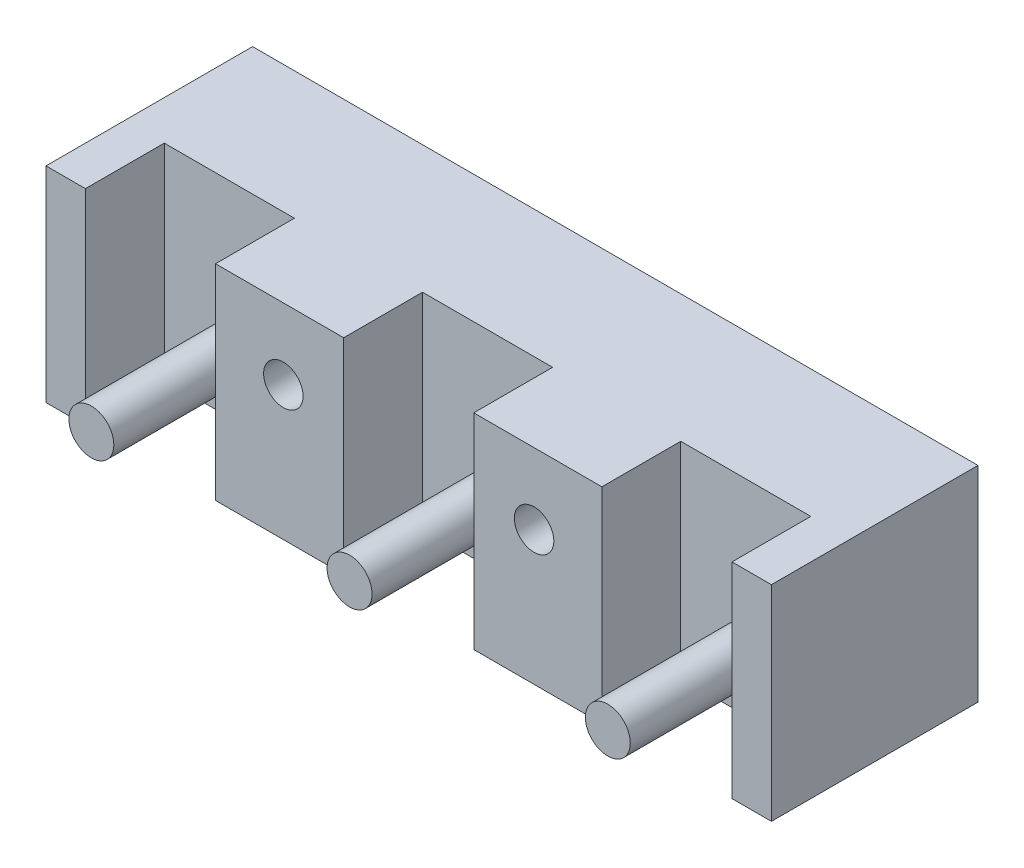
ISO-10303-21;
HEADER;
FILE_DESCRIPTION(('STEP AP214'),'2;1');
FILE_NAME('part.step','',(''),(''),'','','');
FILE_SCHEMA(('AUTOMOTIVE_DESIGN { 1 0 10303 214 1 1 1 1 }'));
ENDSEC;
DATA;
#1=APPLICATION_CONTEXT('core data for automotive mechanical design processes');
#2=APPLICATION_PROTOCOL_DEFINITION('international standard','automotive_design',2000,#1);
#3=PRODUCT_CONTEXT('',#1,'mechanical');
#4=PRODUCT('Part','Part','',(#3));
#5=PRODUCT_RELATED_PRODUCT_CATEGORY('part','',(#4));
#6=PRODUCT_DEFINITION_FORMATION('','',#4);
#7=PRODUCT_DEFINITION_CONTEXT('part definition',#1,'design');
#8=PRODUCT_DEFINITION('design','',#6,#7);
#9=PRODUCT_DEFINITION_SHAPE('','',#8);
#10=(LENGTH_UNIT() NAMED_UNIT(*) SI_UNIT(.MILLI.,.METRE.));
#11=(NAMED_UNIT(*) PLANE_ANGLE_UNIT() SI_UNIT($,.RADIAN.));
#12=(NAMED_UNIT(*) SI_UNIT($,.STERADIAN.) SOLID_ANGLE_UNIT());
#13=UNCERTAINTY_MEASURE_WITH_UNIT(LENGTH_MEASURE(1.E-05),#10,'distance_accuracy_value','');
#14=(GEOMETRIC_REPRESENTATION_CONTEXT(3) GLOBAL_UNCERTAINTY_ASSIGNED_CONTEXT((#13)) GLOBAL_UNIT_ASSIGNED_CONTEXT((#10,
#11,#12)) REPRESENTATION_CONTEXT('',''));
#15=CARTESIAN_POINT('',(0.,0.,0.));
#16=DIRECTION('',(0.,0.,1.));
#17=DIRECTION('',(1.,0.,0.));
#18=AXIS2_PLACEMENT_3D('',#15,#16,#17);
#19=CARTESIAN_POINT('',(0.,0.,26.2));
#20=DIRECTION('',(0.,0.,-1.));
#21=DIRECTION('',(-1.,0.,0.));
#22=AXIS2_PLACEMENT_3D('',#19,#20,#21);
#23=PLANE('',#22);
#24=CARTESIAN_POINT('',(-15.9,4.00000000000001,26.2));
#25=DIRECTION('',(0.,0.,-1.));
#26=DIRECTION('',(-1.,0.,0.));
#27=AXIS2_PLACEMENT_3D('',#24,#25,#26);
#28=CIRCLE('',#27,2.5);
#29=CARTESIAN_POINT('',(-18.4,4.00000000000001,26.2));
#30=VERTEX_POINT('',#29);
#31=EDGE_CURVE('E558',#30,#30,#28,.T.);
#32=ORIENTED_EDGE('',*,*,#31,.T.);
#33=EDGE_LOOP('',(#32));
#34=FACE_BOUND('',#33,.T.);
#35=DIRECTION('',(-1.,0.,0.));
#36=VECTOR('',#35,1.);
#37=CARTESIAN_POINT('',(46.,13.,26.2));
#38=LINE('',#37,#36);
#39=CARTESIAN_POINT('',(-8.25,13.,26.2));
#40=VERTEX_POINT('',#39);
#41=CARTESIAN_POINT('',(-24.5,13.,26.2));
#42=VERTEX_POINT('',#41);
#43=EDGE_CURVE('E304',#40,#42,#38,.T.);
#44=ORIENTED_EDGE('',*,*,#43,.T.);
#45=DIRECTION('',(0.,-1.,0.));
#46=VECTOR('',#45,1.);
#47=CARTESIAN_POINT('',(-24.5,13.,26.2));
#48=LINE('',#47,#46);
#49=CARTESIAN_POINT('',(-24.5,-13.,26.2));
#50=VERTEX_POINT('',#49);
#51=EDGE_CURVE('E180',#42,#50,#48,.T.);
#52=ORIENTED_EDGE('',*,*,#51,.T.);
#53=DIRECTION('',(1.,0.,0.));
#54=VECTOR('',#53,1.);
#55=CARTESIAN_POINT('',(46.,-13.,26.2));
#56=LINE('',#55,#54);
#57=CARTESIAN_POINT('',(-8.25,-13.,26.2));
#58=VERTEX_POINT('',#57);
#59=EDGE_CURVE('E245',#50,#58,#56,.T.);
#60=ORIENTED_EDGE('',*,*,#59,.T.);
#61=DIRECTION('',(0.,-1.,0.));
#62=VECTOR('',#61,1.);
#63=CARTESIAN_POINT('',(-8.25,13.,26.2));
#64=LINE('',#63,#62);
#65=EDGE_CURVE('E178',#40,#58,#64,.T.);
#66=ORIENTED_EDGE('',*,*,#65,.F.);
#67=EDGE_LOOP('',(#44,#52,#60,#66));
#68=FACE_BOUND('',#67,.T.);
#69=ADVANCED_FACE('F34',(#34,#68),#23,.F.);
#70=CARTESIAN_POINT('',(-46.,-13.,26.2));
#71=VERTEX_POINT('',#70);
#72=CARTESIAN_POINT('',(-41.,-13.,26.2));
#73=VERTEX_POINT('',#72);
#74=EDGE_CURVE('E241',#71,#73,#56,.T.);
#75=ORIENTED_EDGE('',*,*,#74,.T.);
#76=DIRECTION('',(0.,-1.,0.));
#77=VECTOR('',#76,1.);
#78=CARTESIAN_POINT('',(-41.,13.,26.2));
#79=LINE('',#78,#77);
#80=CARTESIAN_POINT('',(-41.,13.,26.2));
#81=VERTEX_POINT('',#80);
#82=EDGE_CURVE('E154',#81,#73,#79,.T.);
#83=ORIENTED_EDGE('',*,*,#82,.F.);
#84=CARTESIAN_POINT('',(-46.,13.,26.2));
#85=VERTEX_POINT('',#84);
#86=EDGE_CURVE('E167',#81,#85,#38,.T.);
#87=ORIENTED_EDGE('',*,*,#86,.T.);
#88=DIRECTION('',(0.,-1.,0.));
#89=VECTOR('',#88,1.);
#90=CARTESIAN_POINT('',(-46.,13.,26.2));
#91=LINE('',#90,#89);
#92=EDGE_CURVE('E236',#85,#71,#91,.T.);
#93=ORIENTED_EDGE('',*,*,#92,.T.);
#94=EDGE_LOOP('',(#75,#83,#87,#93));
#95=FACE_BOUND('',#94,.T.);
#96=ADVANCED_FACE('F310',(#95),#23,.F.);
#97=CARTESIAN_POINT('',(46.,13.,26.2));
#98=VERTEX_POINT('',#97);
#99=CARTESIAN_POINT('',(41.,13.,26.2));
#100=VERTEX_POINT('',#99);
#101=EDGE_CURVE('E247',#98,#100,#38,.T.);
#102=ORIENTED_EDGE('',*,*,#101,.T.);
#103=DIRECTION('',(0.,-1.,0.));
#104=VECTOR('',#103,1.);
#105=CARTESIAN_POINT('',(41.,13.,26.2));
#106=LINE('',#105,#104);
#107=CARTESIAN_POINT('',(41.,-13.,26.2));
#108=VERTEX_POINT('',#107);
#109=EDGE_CURVE('E220',#100,#108,#106,.T.);
#110=ORIENTED_EDGE('',*,*,#109,.T.);
#111=CARTESIAN_POINT('',(46.,-13.,26.2));
#112=VERTEX_POINT('',#111);
#113=EDGE_CURVE('E239',#108,#112,#56,.T.);
#114=ORIENTED_EDGE('',*,*,#113,.T.);
#115=DIRECTION('',(0.,1.,0.));
#116=VECTOR('',#115,1.);
#117=CARTESIAN_POINT('',(46.,13.,26.2));
#118=LINE('',#117,#116);
#119=EDGE_CURVE('E244',#112,#98,#118,.T.);
#120=ORIENTED_EDGE('',*,*,#119,.T.);
#121=EDGE_LOOP('',(#102,#110,#114,#120));
#122=FACE_BOUND('',#121,.T.);
#123=ADVANCED_FACE('F295',(#122),#23,.F.);
#124=CARTESIAN_POINT('',(-46.,13.,26.2));
#125=DIRECTION('',(1.,0.,0.));
#126=DIRECTION('',(0.,0.,-1.));
#127=AXIS2_PLACEMENT_3D('',#124,#125,#126);
#128=PLANE('',#127);
#129=DIRECTION('',(0.,-1.,0.));
#130=VECTOR('',#129,1.);
#131=CARTESIAN_POINT('',(-46.,13.,0.));
#132=LINE('',#131,#130);
#133=CARTESIAN_POINT('',(-46.,13.,0.));
#134=VERTEX_POINT('',#133);
#135=CARTESIAN_POINT('',(-46.,-13.,0.));
#136=VERTEX_POINT('',#135);
#137=EDGE_CURVE('E183',#134,#136,#132,.T.);
#138=ORIENTED_EDGE('',*,*,#137,.T.);
#139=DIRECTION('',(0.,0.,-1.));
#140=VECTOR('',#139,1.);
#141=CARTESIAN_POINT('',(-46.,-13.,26.2));
#142=LINE('',#141,#140);
#143=EDGE_CURVE('E267',#71,#136,#142,.T.);
#144=ORIENTED_EDGE('',*,*,#143,.F.);
#145=ORIENTED_EDGE('',*,*,#92,.F.);
#146=DIRECTION('',(0.,0.,-1.));
#147=VECTOR('',#146,1.);
#148=CARTESIAN_POINT('',(-46.,13.,26.2));
#149=LINE('',#148,#147);
#150=EDGE_CURVE('E250',#85,#134,#149,.T.);
#151=ORIENTED_EDGE('',*,*,#150,.T.);
#152=EDGE_LOOP('',(#138,#144,#145,#151));
#153=FACE_BOUND('',#152,.T.);
#154=ADVANCED_FACE('F36',(#153),#128,.F.);
#155=CARTESIAN_POINT('',(46.,-13.,26.2));
#156=DIRECTION('',(0.,1.,0.));
#157=DIRECTION('',(-1.,0.,0.));
#158=AXIS2_PLACEMENT_3D('',#155,#156,#157);
#159=PLANE('',#158);
#160=ORIENTED_EDGE('',*,*,#59,.F.);
#161=DIRECTION('',(0.,0.,1.));
#162=VECTOR('',#161,1.);
#163=CARTESIAN_POINT('',(-24.5,-13.,16.2));
#164=LINE('',#163,#162);
#165=CARTESIAN_POINT('',(-24.5,-13.,16.2));
#166=VERTEX_POINT('',#165);
#167=EDGE_CURVE('E168',#166,#50,#164,.T.);
#168=ORIENTED_EDGE('',*,*,#167,.F.);
#169=DIRECTION('',(1.,0.,0.));
#170=VECTOR('',#169,1.);
#171=CARTESIAN_POINT('',(-41.,-13.,16.2));
#172=LINE('',#171,#170);
#173=CARTESIAN_POINT('',(-41.,-13.,16.2));
#174=VERTEX_POINT('',#173);
#175=EDGE_CURVE('E170',#174,#166,#172,.T.);
#176=ORIENTED_EDGE('',*,*,#175,.F.);
#177=DIRECTION('',(0.,0.,-1.));
#178=VECTOR('',#177,1.);
#179=CARTESIAN_POINT('',(-41.,-13.,26.2));
#180=LINE('',#179,#178);
#181=EDGE_CURVE('E149',#73,#174,#180,.T.);
#182=ORIENTED_EDGE('',*,*,#181,.F.);
#183=ORIENTED_EDGE('',*,*,#74,.F.);
#184=ORIENTED_EDGE('',*,*,#143,.T.);
#185=DIRECTION('',(1.,0.,0.));
#186=VECTOR('',#185,1.);
#187=CARTESIAN_POINT('',(46.,-13.,0.));
#188=LINE('',#187,#186);
#189=CARTESIAN_POINT('',(46.,-13.,0.));
#190=VERTEX_POINT('',#189);
#191=EDGE_CURVE('E254',#136,#190,#188,.T.);
#192=ORIENTED_EDGE('',*,*,#191,.T.);
#193=DIRECTION('',(0.,0.,-1.));
#194=VECTOR('',#193,1.);
#195=CARTESIAN_POINT('',(46.,-13.,26.2));
#196=LINE('',#195,#194);
#197=EDGE_CURVE('E264',#112,#190,#196,.T.);
#198=ORIENTED_EDGE('',*,*,#197,.F.);
#199=ORIENTED_EDGE('',*,*,#113,.F.);
#200=DIRECTION('',(0.,0.,1.));
#201=VECTOR('',#200,1.);
#202=CARTESIAN_POINT('',(41.,-13.,16.2));
#203=LINE('',#202,#201);
#204=CARTESIAN_POINT('',(41.,-13.,16.2));
#205=VERTEX_POINT('',#204);
#206=EDGE_CURVE('E221',#205,#108,#203,.T.);
#207=ORIENTED_EDGE('',*,*,#206,.F.);
#208=DIRECTION('',(1.,0.,0.));
#209=VECTOR('',#208,1.);
#210=CARTESIAN_POINT('',(41.,-13.,16.2));
#211=LINE('',#210,#209);
#212=CARTESIAN_POINT('',(24.5,-13.,16.2));
#213=VERTEX_POINT('',#212);
#214=EDGE_CURVE('E215',#213,#205,#211,.T.);
#215=ORIENTED_EDGE('',*,*,#214,.F.);
#216=DIRECTION('',(0.,0.,-1.));
#217=VECTOR('',#216,1.);
#218=CARTESIAN_POINT('',(24.5,-13.,16.2));
#219=LINE('',#218,#217);
#220=CARTESIAN_POINT('',(24.5,-13.,26.2));
#221=VERTEX_POINT('',#220);
#222=EDGE_CURVE('E223',#221,#213,#219,.T.);
#223=ORIENTED_EDGE('',*,*,#222,.F.);
#224=CARTESIAN_POINT('',(8.25,-13.,26.2));
#225=VERTEX_POINT('',#224);
#226=EDGE_CURVE('E320',#225,#221,#56,.T.);
#227=ORIENTED_EDGE('',*,*,#226,.F.);
#228=DIRECTION('',(0.,0.,1.));
#229=VECTOR('',#228,1.);
#230=CARTESIAN_POINT('',(8.25,-13.,26.2));
#231=LINE('',#230,#229);
#232=CARTESIAN_POINT('',(8.25,-13.,16.2));
#233=VERTEX_POINT('',#232);
#234=EDGE_CURVE('E190',#233,#225,#231,.T.);
#235=ORIENTED_EDGE('',*,*,#234,.F.);
#236=DIRECTION('',(1.,0.,0.));
#237=VECTOR('',#236,1.);
#238=CARTESIAN_POINT('',(-8.25,-13.,16.2));
#239=LINE('',#238,#237);
#240=CARTESIAN_POINT('',(-8.25,-13.,16.2));
#241=VERTEX_POINT('',#240);
#242=EDGE_CURVE('E200',#241,#233,#239,.T.);
#243=ORIENTED_EDGE('',*,*,#242,.F.);
#244=DIRECTION('',(0.,0.,-1.));
#245=VECTOR('',#244,1.);
#246=CARTESIAN_POINT('',(-8.25,-13.,26.2));
#247=LINE('',#246,#245);
#248=EDGE_CURVE('E197',#58,#241,#247,.T.);
#249=ORIENTED_EDGE('',*,*,#248,.F.);
#250=EDGE_LOOP('',(#160,#168,#176,#182,#183,#184,#192,#198,#199,#207,#215,#223,#227,#235,#243,#249));
#251=FACE_BOUND('',#250,.T.);
#252=ADVANCED_FACE('F291',(#251),#159,.F.);
#253=CARTESIAN_POINT('',(46.,13.,26.2));
#254=DIRECTION('',(-1.,0.,0.));
#255=DIRECTION('',(0.,0.,1.));
#256=AXIS2_PLACEMENT_3D('',#253,#254,#255);
#257=PLANE('',#256);
#258=DIRECTION('',(0.,1.,0.));
#259=VECTOR('',#258,1.);
#260=CARTESIAN_POINT('',(46.,13.,0.));
#261=LINE('',#260,#259);
#262=CARTESIAN_POINT('',(46.,13.,0.));
#263=VERTEX_POINT('',#262);
#264=EDGE_CURVE('E256',#190,#263,#261,.T.);
#265=ORIENTED_EDGE('',*,*,#264,.T.);
#266=DIRECTION('',(0.,0.,-1.));
#267=VECTOR('',#266,1.);
#268=CARTESIAN_POINT('',(46.,13.,26.2));
#269=LINE('',#268,#267);
#270=EDGE_CURVE('E261',#98,#263,#269,.T.);
#271=ORIENTED_EDGE('',*,*,#270,.F.);
#272=ORIENTED_EDGE('',*,*,#119,.F.);
#273=ORIENTED_EDGE('',*,*,#197,.T.);
#274=EDGE_LOOP('',(#265,#271,#272,#273));
#275=FACE_BOUND('',#274,.T.);
#276=ADVANCED_FACE('F352',(#275),#257,.F.);
#277=CARTESIAN_POINT('',(46.,13.,26.2));
#278=DIRECTION('',(0.,-1.,0.));
#279=DIRECTION('',(1.,0.,0.));
#280=AXIS2_PLACEMENT_3D('',#277,#278,#279);
#281=PLANE('',#280);
#282=DIRECTION('',(1.,0.,0.));
#283=VECTOR('',#282,1.);
#284=CARTESIAN_POINT('',(-41.,13.,16.2));
#285=LINE('',#284,#283);
#286=CARTESIAN_POINT('',(-41.,13.,16.2));
#287=VERTEX_POINT('',#286);
#288=CARTESIAN_POINT('',(-24.5,13.,16.2));
#289=VERTEX_POINT('',#288);
#290=EDGE_CURVE('E157',#287,#289,#285,.T.);
#291=ORIENTED_EDGE('',*,*,#290,.T.);
#292=DIRECTION('',(0.,0.,1.));
#293=VECTOR('',#292,1.);
#294=CARTESIAN_POINT('',(-24.5,13.,16.2));
#295=LINE('',#294,#293);
#296=EDGE_CURVE('E162',#289,#42,#295,.T.);
#297=ORIENTED_EDGE('',*,*,#296,.T.);
#298=ORIENTED_EDGE('',*,*,#43,.F.);
#299=DIRECTION('',(0.,0.,-1.));
#300=VECTOR('',#299,1.);
#301=CARTESIAN_POINT('',(-8.25,13.,26.2));
#302=LINE('',#301,#300);
#303=CARTESIAN_POINT('',(-8.25,13.,16.2));
#304=VERTEX_POINT('',#303);
#305=EDGE_CURVE('E186',#40,#304,#302,.T.);
#306=ORIENTED_EDGE('',*,*,#305,.T.);
#307=DIRECTION('',(1.,0.,0.));
#308=VECTOR('',#307,1.);
#309=CARTESIAN_POINT('',(-8.25,13.,16.2));
#310=LINE('',#309,#308);
#311=CARTESIAN_POINT('',(8.25,13.,16.2));
#312=VERTEX_POINT('',#311);
#313=EDGE_CURVE('E189',#304,#312,#310,.T.);
#314=ORIENTED_EDGE('',*,*,#313,.T.);
#315=DIRECTION('',(0.,0.,1.));
#316=VECTOR('',#315,1.);
#317=CARTESIAN_POINT('',(8.25,13.,26.2));
#318=LINE('',#317,#316);
#319=CARTESIAN_POINT('',(8.25,13.,26.2));
#320=VERTEX_POINT('',#319);
#321=EDGE_CURVE('E193',#312,#320,#318,.T.);
#322=ORIENTED_EDGE('',*,*,#321,.T.);
#323=CARTESIAN_POINT('',(24.5,13.,26.2));
#324=VERTEX_POINT('',#323);
#325=EDGE_CURVE('E251',#324,#320,#38,.T.);
#326=ORIENTED_EDGE('',*,*,#325,.F.);
#327=DIRECTION('',(0.,0.,-1.));
#328=VECTOR('',#327,1.);
#329=CARTESIAN_POINT('',(24.5,13.,16.2));
#330=LINE('',#329,#328);
#331=CARTESIAN_POINT('',(24.5,13.,16.2));
#332=VERTEX_POINT('',#331);
#333=EDGE_CURVE('E57',#324,#332,#330,.T.);
#334=ORIENTED_EDGE('',*,*,#333,.T.);
#335=DIRECTION('',(1.,0.,0.));
#336=VECTOR('',#335,1.);
#337=CARTESIAN_POINT('',(41.,13.,16.2));
#338=LINE('',#337,#336);
#339=CARTESIAN_POINT('',(41.,13.,16.2));
#340=VERTEX_POINT('',#339);
#341=EDGE_CURVE('E217',#332,#340,#338,.T.);
#342=ORIENTED_EDGE('',*,*,#341,.T.);
#343=DIRECTION('',(0.,0.,1.));
#344=VECTOR('',#343,1.);
#345=CARTESIAN_POINT('',(41.,13.,16.2));
#346=LINE('',#345,#344);
#347=EDGE_CURVE('E212',#340,#100,#346,.T.);
#348=ORIENTED_EDGE('',*,*,#347,.T.);
#349=ORIENTED_EDGE('',*,*,#101,.F.);
#350=ORIENTED_EDGE('',*,*,#270,.T.);
#351=DIRECTION('',(-1.,0.,0.));
#352=VECTOR('',#351,1.);
#353=CARTESIAN_POINT('',(46.,13.,0.));
#354=LINE('',#353,#352);
#355=EDGE_CURVE('E240',#263,#134,#354,.T.);
#356=ORIENTED_EDGE('',*,*,#355,.T.);
#357=ORIENTED_EDGE('',*,*,#150,.F.);
#358=ORIENTED_EDGE('',*,*,#86,.F.);
#359=DIRECTION('',(0.,0.,-1.));
#360=VECTOR('',#359,1.);
#361=CARTESIAN_POINT('',(-41.,13.,26.2));
#362=LINE('',#361,#360);
#363=EDGE_CURVE('E49',#81,#287,#362,.T.);
#364=ORIENTED_EDGE('',*,*,#363,.T.);
#365=EDGE_LOOP('',(#291,#297,#298,#306,#314,#322,#326,#334,#342,#348,#349,#350,#356,#357,#358,#364));
#366=FACE_BOUND('',#365,.T.);
#367=ADVANCED_FACE('F165',(#366),#281,.F.);
#368=CARTESIAN_POINT('',(15.9,4.00000000000001,26.2));
#369=DIRECTION('',(0.,0.,-1.));
#370=DIRECTION('',(-1.,0.,0.));
#371=AXIS2_PLACEMENT_3D('',#368,#369,#370);
#372=CIRCLE('',#371,2.5);
#373=CARTESIAN_POINT('',(13.4,4.00000000000001,26.2));
#374=VERTEX_POINT('',#373);
#375=EDGE_CURVE('E224',#374,#374,#372,.T.);
#376=ORIENTED_EDGE('',*,*,#375,.T.);
#377=EDGE_LOOP('',(#376));
#378=FACE_BOUND('',#377,.T.);
#379=ORIENTED_EDGE('',*,*,#325,.T.);
#380=DIRECTION('',(0.,-1.,0.));
#381=VECTOR('',#380,1.);
#382=CARTESIAN_POINT('',(8.25,13.,26.2));
#383=LINE('',#382,#381);
#384=EDGE_CURVE('E206',#320,#225,#383,.T.);
#385=ORIENTED_EDGE('',*,*,#384,.T.);
#386=ORIENTED_EDGE('',*,*,#226,.T.);
#387=DIRECTION('',(0.,-1.,0.));
#388=VECTOR('',#387,1.);
#389=CARTESIAN_POINT('',(24.5,13.,26.2));
#390=LINE('',#389,#388);
#391=EDGE_CURVE('E232',#324,#221,#390,.T.);
#392=ORIENTED_EDGE('',*,*,#391,.F.);
#393=EDGE_LOOP('',(#379,#385,#386,#392));
#394=FACE_BOUND('',#393,.T.);
#395=ADVANCED_FACE('F323',(#378,#394),#23,.F.);
#396=CARTESIAN_POINT('',(0.,0.,0.));
#397=DIRECTION('',(0.,0.,-1.));
#398=DIRECTION('',(-1.,0.,0.));
#399=AXIS2_PLACEMENT_3D('',#396,#397,#398);
#400=PLANE('',#399);
#401=CARTESIAN_POINT('',(15.9,4.00000000000001,0.));
#402=DIRECTION('',(0.,0.,-1.));
#403=DIRECTION('',(-1.,0.,0.));
#404=AXIS2_PLACEMENT_3D('',#401,#402,#403);
#405=CIRCLE('',#404,2.5);
#406=CARTESIAN_POINT('',(13.4,4.00000000000001,0.));
#407=VERTEX_POINT('',#406);
#408=EDGE_CURVE('E556',#407,#407,#405,.T.);
#409=ORIENTED_EDGE('',*,*,#408,.F.);
#410=EDGE_LOOP('',(#409));
#411=FACE_BOUND('',#410,.T.);
#412=CARTESIAN_POINT('',(-15.9,4.00000000000001,0.));
#413=DIRECTION('',(0.,0.,-1.));
#414=DIRECTION('',(-1.,0.,0.));
#415=AXIS2_PLACEMENT_3D('',#412,#413,#414);
#416=CIRCLE('',#415,2.5);
#417=CARTESIAN_POINT('',(-18.4,4.00000000000001,0.));
#418=VERTEX_POINT('',#417);
#419=EDGE_CURVE('E173',#418,#418,#416,.T.);
#420=ORIENTED_EDGE('',*,*,#419,.F.);
#421=EDGE_LOOP('',(#420));
#422=FACE_BOUND('',#421,.T.);
#423=ORIENTED_EDGE('',*,*,#137,.F.);
#424=ORIENTED_EDGE('',*,*,#355,.F.);
#425=ORIENTED_EDGE('',*,*,#264,.F.);
#426=ORIENTED_EDGE('',*,*,#191,.F.);
#427=EDGE_LOOP('',(#423,#424,#425,#426));
#428=FACE_BOUND('',#427,.T.);
#429=ADVANCED_FACE('F345',(#411,#422,#428),#400,.T.);
#430=CARTESIAN_POINT('',(41.,13.,16.2));
#431=DIRECTION('',(1.,0.,0.));
#432=DIRECTION('',(0.,1.,0.));
#433=AXIS2_PLACEMENT_3D('',#430,#431,#432);
#434=PLANE('',#433);
#435=ORIENTED_EDGE('',*,*,#206,.T.);
#436=ORIENTED_EDGE('',*,*,#109,.F.);
#437=ORIENTED_EDGE('',*,*,#347,.F.);
#438=DIRECTION('',(0.,-1.,0.));
#439=VECTOR('',#438,1.);
#440=CARTESIAN_POINT('',(41.,13.,16.2));
#441=LINE('',#440,#439);
#442=EDGE_CURVE('E201',#340,#205,#441,.T.);
#443=ORIENTED_EDGE('',*,*,#442,.T.);
#444=EDGE_LOOP('',(#435,#436,#437,#443));
#445=FACE_BOUND('',#444,.T.);
#446=ADVANCED_FACE('F281',(#445),#434,.F.);
#447=CARTESIAN_POINT('',(41.,13.,16.2));
#448=DIRECTION('',(0.,0.,-1.));
#449=DIRECTION('',(-1.,0.,0.));
#450=AXIS2_PLACEMENT_3D('',#447,#448,#449);
#451=PLANE('',#450);
#452=CARTESIAN_POINT('',(32.75,-5.85,16.2));
#453=DIRECTION('',(0.,0.,-1.));
#454=DIRECTION('',(-1.,0.,0.));
#455=AXIS2_PLACEMENT_3D('',#452,#453,#454);
#456=CIRCLE('',#455,2.84999999999999);
#457=CARTESIAN_POINT('',(29.9,-5.85,16.2));
#458=VERTEX_POINT('',#457);
#459=EDGE_CURVE('E42',#458,#458,#456,.F.);
#460=ORIENTED_EDGE('',*,*,#459,.F.);
#461=EDGE_LOOP('',(#460));
#462=FACE_BOUND('',#461,.T.);
#463=ORIENTED_EDGE('',*,*,#214,.T.);
#464=ORIENTED_EDGE('',*,*,#442,.F.);
#465=ORIENTED_EDGE('',*,*,#341,.F.);
#466=DIRECTION('',(0.,-1.,0.));
#467=VECTOR('',#466,1.);
#468=CARTESIAN_POINT('',(24.5,13.,16.2));
#469=LINE('',#468,#467);
#470=EDGE_CURVE('E230',#332,#213,#469,.T.);
#471=ORIENTED_EDGE('',*,*,#470,.T.);
#472=EDGE_LOOP('',(#463,#464,#465,#471));
#473=FACE_BOUND('',#472,.T.);
#474=ADVANCED_FACE('F277',(#462,#473),#451,.F.);
#475=CARTESIAN_POINT('',(24.5,13.,16.2));
#476=DIRECTION('',(-1.,0.,0.));
#477=DIRECTION('',(0.,0.,1.));
#478=AXIS2_PLACEMENT_3D('',#475,#476,#477);
#479=PLANE('',#478);
#480=ORIENTED_EDGE('',*,*,#222,.T.);
#481=ORIENTED_EDGE('',*,*,#470,.F.);
#482=ORIENTED_EDGE('',*,*,#333,.F.);
#483=ORIENTED_EDGE('',*,*,#391,.T.);
#484=EDGE_LOOP('',(#480,#481,#482,#483));
#485=FACE_BOUND('',#484,.T.);
#486=ADVANCED_FACE('F280',(#485),#479,.F.);
#487=CARTESIAN_POINT('',(-8.25,13.,26.2));
#488=DIRECTION('',(-1.,0.,0.));
#489=DIRECTION('',(0.,-1.,0.));
#490=AXIS2_PLACEMENT_3D('',#487,#488,#489);
#491=PLANE('',#490);
#492=ORIENTED_EDGE('',*,*,#248,.T.);
#493=DIRECTION('',(0.,-1.,0.));
#494=VECTOR('',#493,1.);
#495=CARTESIAN_POINT('',(-8.25,13.,16.2));
#496=LINE('',#495,#494);
#497=EDGE_CURVE('E196',#304,#241,#496,.T.);
#498=ORIENTED_EDGE('',*,*,#497,.F.);
#499=ORIENTED_EDGE('',*,*,#305,.F.);
#500=ORIENTED_EDGE('',*,*,#65,.T.);
#501=EDGE_LOOP('',(#492,#498,#499,#500));
#502=FACE_BOUND('',#501,.T.);
#503=ADVANCED_FACE('F327',(#502),#491,.F.);
#504=CARTESIAN_POINT('',(8.25,13.,26.2));
#505=DIRECTION('',(1.,0.,0.));
#506=DIRECTION('',(0.,1.,0.));
#507=AXIS2_PLACEMENT_3D('',#504,#505,#506);
#508=PLANE('',#507);
#509=ORIENTED_EDGE('',*,*,#234,.T.);
#510=ORIENTED_EDGE('',*,*,#384,.F.);
#511=ORIENTED_EDGE('',*,*,#321,.F.);
#512=DIRECTION('',(0.,-1.,0.));
#513=VECTOR('',#512,1.);
#514=CARTESIAN_POINT('',(8.25,13.,16.2));
#515=LINE('',#514,#513);
#516=EDGE_CURVE('E209',#312,#233,#515,.T.);
#517=ORIENTED_EDGE('',*,*,#516,.T.);
#518=EDGE_LOOP('',(#509,#510,#511,#517));
#519=FACE_BOUND('',#518,.T.);
#520=ADVANCED_FACE('F332',(#519),#508,.F.);
#521=CARTESIAN_POINT('',(-8.25,13.,16.2));
#522=DIRECTION('',(0.,0.,-1.));
#523=DIRECTION('',(-1.,0.,0.));
#524=AXIS2_PLACEMENT_3D('',#521,#522,#523);
#525=PLANE('',#524);
#526=CARTESIAN_POINT('',(0.,-5.85,16.2));
#527=DIRECTION('',(0.,0.,-1.));
#528=DIRECTION('',(-1.,0.,0.));
#529=AXIS2_PLACEMENT_3D('',#526,#527,#528);
#530=CIRCLE('',#529,2.85);
#531=CARTESIAN_POINT('',(-2.85000000000001,-5.85,16.2));
#532=VERTEX_POINT('',#531);
#533=EDGE_CURVE('E270',#532,#532,#530,.F.);
#534=ORIENTED_EDGE('',*,*,#533,.F.);
#535=EDGE_LOOP('',(#534));
#536=FACE_BOUND('',#535,.T.);
#537=ORIENTED_EDGE('',*,*,#242,.T.);
#538=ORIENTED_EDGE('',*,*,#516,.F.);
#539=ORIENTED_EDGE('',*,*,#313,.F.);
#540=ORIENTED_EDGE('',*,*,#497,.T.);
#541=EDGE_LOOP('',(#537,#538,#539,#540));
#542=FACE_BOUND('',#541,.T.);
#543=ADVANCED_FACE('F407',(#536,#542),#525,.F.);
#544=CARTESIAN_POINT('',(-24.5,13.,16.2));
#545=DIRECTION('',(1.,0.,0.));
#546=DIRECTION('',(0.,1.,0.));
#547=AXIS2_PLACEMENT_3D('',#544,#545,#546);
#548=PLANE('',#547);
#549=ORIENTED_EDGE('',*,*,#167,.T.);
#550=ORIENTED_EDGE('',*,*,#51,.F.);
#551=ORIENTED_EDGE('',*,*,#296,.F.);
#552=DIRECTION('',(0.,-1.,0.));
#553=VECTOR('',#552,1.);
#554=CARTESIAN_POINT('',(-24.5,13.,16.2));
#555=LINE('',#554,#553);
#556=EDGE_CURVE('E153',#289,#166,#555,.T.);
#557=ORIENTED_EDGE('',*,*,#556,.T.);
#558=EDGE_LOOP('',(#549,#550,#551,#557));
#559=FACE_BOUND('',#558,.T.);
#560=ADVANCED_FACE('F319',(#559),#548,.F.);
#561=CARTESIAN_POINT('',(-41.,13.,16.2));
#562=DIRECTION('',(0.,0.,-1.));
#563=DIRECTION('',(-1.,0.,0.));
#564=AXIS2_PLACEMENT_3D('',#561,#562,#563);
#565=PLANE('',#564);
#566=CARTESIAN_POINT('',(-32.75,-5.85000000000001,16.2));
#567=DIRECTION('',(0.,0.,-1.));
#568=DIRECTION('',(-1.,0.,0.));
#569=AXIS2_PLACEMENT_3D('',#566,#567,#568);
#570=CIRCLE('',#569,2.85);
#571=CARTESIAN_POINT('',(-35.6,-5.85000000000001,16.2));
#572=VERTEX_POINT('',#571);
#573=EDGE_CURVE('E11',#572,#572,#570,.F.);
#574=ORIENTED_EDGE('',*,*,#573,.F.);
#575=EDGE_LOOP('',(#574));
#576=FACE_BOUND('',#575,.T.);
#577=ORIENTED_EDGE('',*,*,#175,.T.);
#578=ORIENTED_EDGE('',*,*,#556,.F.);
#579=ORIENTED_EDGE('',*,*,#290,.F.);
#580=DIRECTION('',(0.,-1.,0.));
#581=VECTOR('',#580,1.);
#582=CARTESIAN_POINT('',(-41.,13.,16.2));
#583=LINE('',#582,#581);
#584=EDGE_CURVE('E145',#287,#174,#583,.T.);
#585=ORIENTED_EDGE('',*,*,#584,.T.);
#586=EDGE_LOOP('',(#577,#578,#579,#585));
#587=FACE_BOUND('',#586,.T.);
#588=ADVANCED_FACE('F158',(#576,#587),#565,.F.);
#589=CARTESIAN_POINT('',(-41.,13.,26.2));
#590=DIRECTION('',(-1.,0.,0.));
#591=DIRECTION('',(0.,-1.,0.));
#592=AXIS2_PLACEMENT_3D('',#589,#590,#591);
#593=PLANE('',#592);
#594=ORIENTED_EDGE('',*,*,#181,.T.);
#595=ORIENTED_EDGE('',*,*,#584,.F.);
#596=ORIENTED_EDGE('',*,*,#363,.F.);
#597=ORIENTED_EDGE('',*,*,#82,.T.);
#598=EDGE_LOOP('',(#594,#595,#596,#597));
#599=FACE_BOUND('',#598,.T.);
#600=ADVANCED_FACE('F147',(#599),#593,.F.);
#601=CARTESIAN_POINT('',(-15.9,4.00000000000001,26.2));
#602=DIRECTION('',(0.,0.,-1.));
#603=DIRECTION('',(-1.,0.,0.));
#604=AXIS2_PLACEMENT_3D('',#601,#602,#603);
#605=CYLINDRICAL_SURFACE('',#604,2.5);
#606=ORIENTED_EDGE('',*,*,#31,.F.);
#607=EDGE_LOOP('',(#606));
#608=FACE_BOUND('',#607,.T.);
#609=ORIENTED_EDGE('',*,*,#419,.T.);
#610=EDGE_LOOP('',(#609));
#611=FACE_BOUND('',#610,.T.);
#612=ADVANCED_FACE('F428',(#608,#611),#605,.F.);
#613=CARTESIAN_POINT('',(15.9,4.00000000000001,26.2));
#614=DIRECTION('',(0.,0.,-1.));
#615=DIRECTION('',(-1.,0.,0.));
#616=AXIS2_PLACEMENT_3D('',#613,#614,#615);
#617=CYLINDRICAL_SURFACE('',#616,2.5);
#618=ORIENTED_EDGE('',*,*,#375,.F.);
#619=EDGE_LOOP('',(#618));
#620=FACE_BOUND('',#619,.T.);
#621=ORIENTED_EDGE('',*,*,#408,.T.);
#622=EDGE_LOOP('',(#621));
#623=FACE_BOUND('',#622,.T.);
#624=ADVANCED_FACE('F452',(#620,#623),#617,.F.);
#625=CARTESIAN_POINT('',(0.,-5.85,33.7));
#626=DIRECTION('',(0.,0.,-1.));
#627=DIRECTION('',(-1.,0.,0.));
#628=AXIS2_PLACEMENT_3D('',#625,#626,#627);
#629=CYLINDRICAL_SURFACE('',#628,2.85);
#630=CARTESIAN_POINT('',(0.,-5.85,33.7));
#631=DIRECTION('',(0.,0.,1.));
#632=DIRECTION('',(1.,0.,0.));
#633=AXIS2_PLACEMENT_3D('',#630,#631,#632);
#634=CIRCLE('',#633,2.85);
#635=CARTESIAN_POINT('',(2.84999999999999,-5.85,33.7));
#636=VERTEX_POINT('',#635);
#637=EDGE_CURVE('E550',#636,#636,#634,.T.);
#638=ORIENTED_EDGE('',*,*,#637,.F.);
#639=EDGE_LOOP('',(#638));
#640=FACE_BOUND('',#639,.T.);
#641=ORIENTED_EDGE('',*,*,#533,.T.);
#642=EDGE_LOOP('',(#641));
#643=FACE_BOUND('',#642,.T.);
#644=ADVANCED_FACE('F462',(#640,#643),#629,.T.);
#645=CARTESIAN_POINT('',(0.,-5.85,33.7));
#646=DIRECTION('',(0.,0.,1.));
#647=DIRECTION('',(1.,0.,0.));
#648=AXIS2_PLACEMENT_3D('',#645,#646,#647);
#649=PLANE('',#648);
#650=ORIENTED_EDGE('',*,*,#637,.T.);
#651=EDGE_LOOP('',(#650));
#652=FACE_BOUND('',#651,.T.);
#653=ADVANCED_FACE('F491',(#652),#649,.T.);
#654=CARTESIAN_POINT('',(32.75,-5.85,33.7));
#655=DIRECTION('',(0.,0.,-1.));
#656=DIRECTION('',(-1.,0.,0.));
#657=AXIS2_PLACEMENT_3D('',#654,#655,#656);
#658=CYLINDRICAL_SURFACE('',#657,2.84999999999999);
#659=CARTESIAN_POINT('',(32.75,-5.85,33.7));
#660=DIRECTION('',(0.,0.,1.));
#661=DIRECTION('',(1.,0.,0.));
#662=AXIS2_PLACEMENT_3D('',#659,#660,#661);
#663=CIRCLE('',#662,2.84999999999999);
#664=CARTESIAN_POINT('',(35.6,-5.85,33.7));
#665=VERTEX_POINT('',#664);
#666=EDGE_CURVE('E547',#665,#665,#663,.T.);
#667=ORIENTED_EDGE('',*,*,#666,.F.);
#668=EDGE_LOOP('',(#667));
#669=FACE_BOUND('',#668,.T.);
#670=ORIENTED_EDGE('',*,*,#459,.T.);
#671=EDGE_LOOP('',(#670));
#672=FACE_BOUND('',#671,.T.);
#673=ADVANCED_FACE('F275',(#669,#672),#658,.T.);
#674=CARTESIAN_POINT('',(32.75,-5.85,33.7));
#675=DIRECTION('',(0.,0.,1.));
#676=DIRECTION('',(1.,0.,0.));
#677=AXIS2_PLACEMENT_3D('',#674,#675,#676);
#678=PLANE('',#677);
#679=ORIENTED_EDGE('',*,*,#666,.T.);
#680=EDGE_LOOP('',(#679));
#681=FACE_BOUND('',#680,.T.);
#682=ADVANCED_FACE('F510',(#681),#678,.T.);
#683=CARTESIAN_POINT('',(-32.75,-5.85000000000001,33.7));
#684=DIRECTION('',(0.,0.,-1.));
#685=DIRECTION('',(-1.,0.,0.));
#686=AXIS2_PLACEMENT_3D('',#683,#684,#685);
#687=CYLINDRICAL_SURFACE('',#686,2.85);
#688=CARTESIAN_POINT('',(-32.75,-5.85000000000001,33.7));
#689=DIRECTION('',(0.,0.,1.));
#690=DIRECTION('',(1.,0.,0.));
#691=AXIS2_PLACEMENT_3D('',#688,#689,#690);
#692=CIRCLE('',#691,2.85);
#693=CARTESIAN_POINT('',(-29.9,-5.85000000000001,33.7));
#694=VERTEX_POINT('',#693);
#695=EDGE_CURVE('E546',#694,#694,#692,.T.);
#696=ORIENTED_EDGE('',*,*,#695,.F.);
#697=EDGE_LOOP('',(#696));
#698=FACE_BOUND('',#697,.T.);
#699=ORIENTED_EDGE('',*,*,#573,.T.);
#700=EDGE_LOOP('',(#699));
#701=FACE_BOUND('',#700,.T.);
#702=ADVANCED_FACE('F520',(#698,#701),#687,.T.);
#703=CARTESIAN_POINT('',(-32.75,-5.85000000000001,33.7));
#704=DIRECTION('',(0.,0.,1.));
#705=DIRECTION('',(1.,0.,0.));
#706=AXIS2_PLACEMENT_3D('',#703,#704,#705);
#707=PLANE('',#706);
#708=ORIENTED_EDGE('',*,*,#695,.T.);
#709=EDGE_LOOP('',(#708));
#710=FACE_BOUND('',#709,.T.);
#711=ADVANCED_FACE('F530',(#710),#707,.T.);
#712=CLOSED_SHELL('',(#69,#96,#123,#154,#252,#276,#367,#395,#429,#446,#474,#486,#503,#520,#543,
#560,#588,#600,#612,#624,#644,#653,#673,#682,#702,#711));
#713=MANIFOLD_SOLID_BREP('B2',#712);
#714=ADVANCED_BREP_SHAPE_REPRESENTATION('',(#18,#713),#14);
#715=SHAPE_DEFINITION_REPRESENTATION(#9,#714);
ENDSEC;
END-ISO-10303-21;
